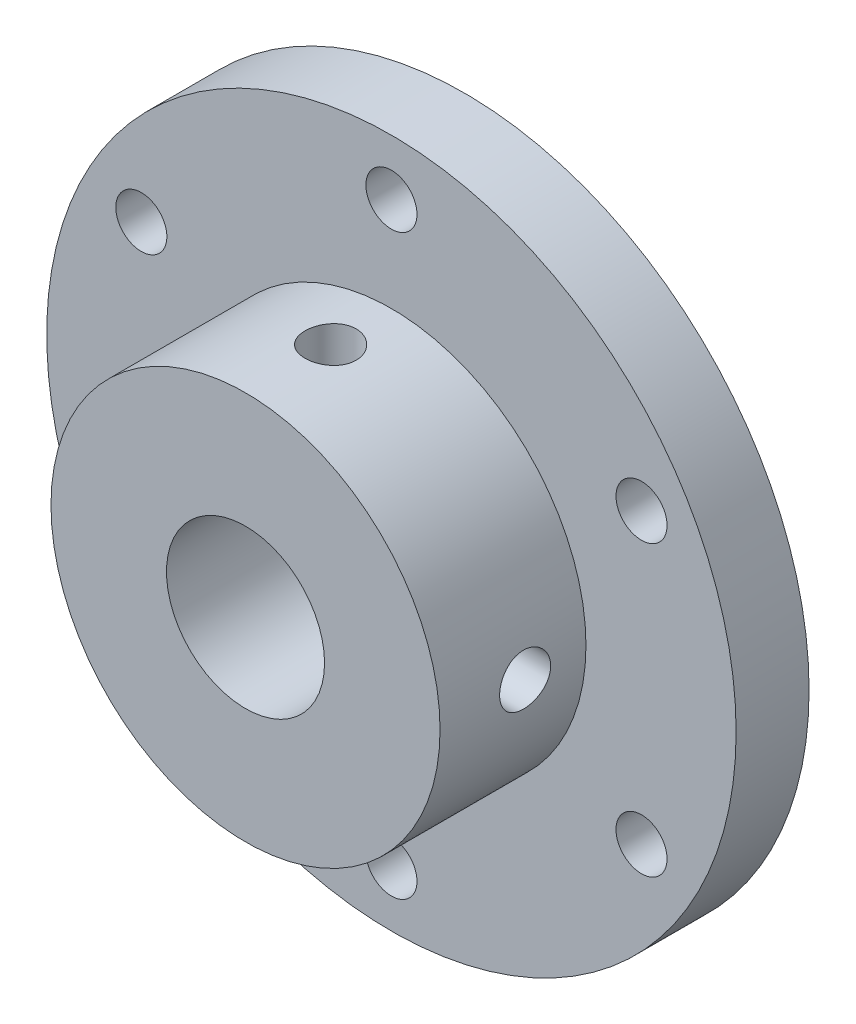
ISO-10303-21;
HEADER;
FILE_DESCRIPTION(('STEP AP214'),'2;1');
FILE_NAME('part.step','',(''),(''),'','','');
FILE_SCHEMA(('AUTOMOTIVE_DESIGN { 1 0 10303 214 1 1 1 1 }'));
ENDSEC;
DATA;
#1=APPLICATION_CONTEXT('core data for automotive mechanical design processes');
#2=APPLICATION_PROTOCOL_DEFINITION('international standard','automotive_design',2000,#1);
#3=PRODUCT_CONTEXT('',#1,'mechanical');
#4=PRODUCT('Part','Part','',(#3));
#5=PRODUCT_RELATED_PRODUCT_CATEGORY('part','',(#4));
#6=PRODUCT_DEFINITION_FORMATION('','',#4);
#7=PRODUCT_DEFINITION_CONTEXT('part definition',#1,'design');
#8=PRODUCT_DEFINITION('design','',#6,#7);
#9=PRODUCT_DEFINITION_SHAPE('','',#8);
#10=(LENGTH_UNIT() NAMED_UNIT(*) SI_UNIT(.MILLI.,.METRE.));
#11=(NAMED_UNIT(*) PLANE_ANGLE_UNIT() SI_UNIT($,.RADIAN.));
#12=(NAMED_UNIT(*) SI_UNIT($,.STERADIAN.) SOLID_ANGLE_UNIT());
#13=UNCERTAINTY_MEASURE_WITH_UNIT(LENGTH_MEASURE(1.E-05),#10,'distance_accuracy_value','');
#14=(GEOMETRIC_REPRESENTATION_CONTEXT(3) GLOBAL_UNCERTAINTY_ASSIGNED_CONTEXT((#13)) GLOBAL_UNIT_ASSIGNED_CONTEXT((#10,
#11,#12)) REPRESENTATION_CONTEXT('',''));
#15=CARTESIAN_POINT('',(0.,0.,0.));
#16=DIRECTION('',(0.,0.,1.));
#17=DIRECTION('',(1.,0.,0.));
#18=AXIS2_PLACEMENT_3D('',#15,#16,#17);
#19=CARTESIAN_POINT('',(0.,0.,6.));
#20=DIRECTION('',(0.,0.,-1.));
#21=DIRECTION('',(-1.,0.,0.));
#22=AXIS2_PLACEMENT_3D('',#19,#20,#21);
#23=CYLINDRICAL_SURFACE('',#22,28.35);
#24=CARTESIAN_POINT('',(0.,0.,6.));
#25=DIRECTION('',(0.,0.,1.));
#26=DIRECTION('',(1.,0.,0.));
#27=AXIS2_PLACEMENT_3D('',#24,#25,#26);
#28=CIRCLE('',#27,28.35);
#29=CARTESIAN_POINT('',(28.35,0.,6.));
#30=VERTEX_POINT('',#29);
#31=EDGE_CURVE('E10',#30,#30,#28,.T.);
#32=ORIENTED_EDGE('',*,*,#31,.F.);
#33=EDGE_LOOP('',(#32));
#34=FACE_BOUND('',#33,.T.);
#35=CARTESIAN_POINT('',(0.,0.,0.));
#36=DIRECTION('',(0.,0.,1.));
#37=DIRECTION('',(1.,0.,0.));
#38=AXIS2_PLACEMENT_3D('',#35,#36,#37);
#39=CIRCLE('',#38,28.35);
#40=CARTESIAN_POINT('',(28.35,0.,0.));
#41=VERTEX_POINT('',#40);
#42=EDGE_CURVE('E34',#41,#41,#39,.T.);
#43=ORIENTED_EDGE('',*,*,#42,.T.);
#44=EDGE_LOOP('',(#43));
#45=FACE_BOUND('',#44,.T.);
#46=ADVANCED_FACE('F31',(#34,#45),#23,.T.);
#47=CARTESIAN_POINT('',(0.,0.,6.));
#48=DIRECTION('',(0.,0.,1.));
#49=DIRECTION('',(1.,0.,0.));
#50=AXIS2_PLACEMENT_3D('',#47,#48,#49);
#51=PLANE('',#50);
#52=CARTESIAN_POINT('',(-20.5681033398804,-11.8750000000001,6.));
#53=DIRECTION('',(0.,0.,1.));
#54=DIRECTION('',(-0.500000000000004,0.866025403784436,0.));
#55=AXIS2_PLACEMENT_3D('',#52,#53,#54);
#56=CIRCLE('',#55,2.09999999999999);
#57=CARTESIAN_POINT('',(-21.6181033398804,-10.0563466520528,6.));
#58=VERTEX_POINT('',#57);
#59=EDGE_CURVE('E84',#58,#58,#56,.T.);
#60=ORIENTED_EDGE('',*,*,#59,.F.);
#61=EDGE_LOOP('',(#60));
#62=FACE_BOUND('',#61,.T.);
#63=CARTESIAN_POINT('',(0.,-23.75,6.));
#64=DIRECTION('',(0.,0.,1.));
#65=DIRECTION('',(-1.,0.,0.));
#66=AXIS2_PLACEMENT_3D('',#63,#64,#65);
#67=CIRCLE('',#66,2.09999999999999);
#68=CARTESIAN_POINT('',(-2.09999999999999,-23.75,6.));
#69=VERTEX_POINT('',#68);
#70=EDGE_CURVE('E78',#69,#69,#67,.T.);
#71=ORIENTED_EDGE('',*,*,#70,.F.);
#72=EDGE_LOOP('',(#71));
#73=FACE_BOUND('',#72,.T.);
#74=CARTESIAN_POINT('',(20.5681033398805,-11.8749999999998,6.));
#75=DIRECTION('',(0.,0.,1.));
#76=DIRECTION('',(-0.499999999999992,-0.866025403784443,0.));
#77=AXIS2_PLACEMENT_3D('',#74,#75,#76);
#78=CIRCLE('',#77,2.09999999999999);
#79=CARTESIAN_POINT('',(19.5181033398806,-13.6936533479471,6.));
#80=VERTEX_POINT('',#79);
#81=EDGE_CURVE('E70',#80,#80,#78,.T.);
#82=ORIENTED_EDGE('',*,*,#81,.F.);
#83=EDGE_LOOP('',(#82));
#84=FACE_BOUND('',#83,.T.);
#85=CARTESIAN_POINT('',(20.5681033398803,11.8750000000002,6.));
#86=DIRECTION('',(0.,0.,1.));
#87=DIRECTION('',(0.50000000000001,-0.866025403784433,0.));
#88=AXIS2_PLACEMENT_3D('',#85,#86,#87);
#89=CIRCLE('',#88,2.09999999999999);
#90=CARTESIAN_POINT('',(21.6181033398803,10.0563466520529,6.));
#91=VERTEX_POINT('',#90);
#92=EDGE_CURVE('E71',#91,#91,#89,.T.);
#93=ORIENTED_EDGE('',*,*,#92,.F.);
#94=EDGE_LOOP('',(#93));
#95=FACE_BOUND('',#94,.T.);
#96=CARTESIAN_POINT('',(-20.5681033398804,11.875,6.));
#97=DIRECTION('',(0.,0.,1.));
#98=DIRECTION('',(0.499999999999998,0.86602540378444,0.));
#99=AXIS2_PLACEMENT_3D('',#96,#97,#98);
#100=CIRCLE('',#99,2.09999999999999);
#101=CARTESIAN_POINT('',(-19.5181033398805,13.6936533479473,6.));
#102=VERTEX_POINT('',#101);
#103=EDGE_CURVE('E63',#102,#102,#100,.T.);
#104=ORIENTED_EDGE('',*,*,#103,.F.);
#105=EDGE_LOOP('',(#104));
#106=FACE_BOUND('',#105,.T.);
#107=CARTESIAN_POINT('',(0.,23.75,6.));
#108=DIRECTION('',(0.,0.,1.));
#109=DIRECTION('',(1.,0.,0.));
#110=AXIS2_PLACEMENT_3D('',#107,#108,#109);
#111=CIRCLE('',#110,2.09999999999999);
#112=CARTESIAN_POINT('',(2.09999999999999,23.75,6.));
#113=VERTEX_POINT('',#112);
#114=EDGE_CURVE('E52',#113,#113,#111,.T.);
#115=ORIENTED_EDGE('',*,*,#114,.F.);
#116=EDGE_LOOP('',(#115));
#117=FACE_BOUND('',#116,.T.);
#118=CARTESIAN_POINT('',(0.,0.,6.));
#119=DIRECTION('',(0.,0.,1.));
#120=DIRECTION('',(1.,0.,0.));
#121=AXIS2_PLACEMENT_3D('',#118,#119,#120);
#122=CIRCLE('',#121,16.);
#123=CARTESIAN_POINT('',(16.,0.,6.));
#124=VERTEX_POINT('',#123);
#125=EDGE_CURVE('E43',#124,#124,#122,.T.);
#126=ORIENTED_EDGE('',*,*,#125,.F.);
#127=EDGE_LOOP('',(#126));
#128=FACE_BOUND('',#127,.T.);
#129=ORIENTED_EDGE('',*,*,#31,.T.);
#130=EDGE_LOOP('',(#129));
#131=FACE_BOUND('',#130,.T.);
#132=ADVANCED_FACE('F145',(#62,#73,#84,#95,#106,#117,#128,#131),#51,.T.);
#133=CARTESIAN_POINT('',(0.,0.,0.));
#134=DIRECTION('',(0.,0.,1.));
#135=DIRECTION('',(1.,0.,0.));
#136=AXIS2_PLACEMENT_3D('',#133,#134,#135);
#137=PLANE('',#136);
#138=CARTESIAN_POINT('',(-20.5681033398804,-11.8750000000001,0.));
#139=DIRECTION('',(0.,0.,-1.));
#140=DIRECTION('',(0.500000000000004,-0.866025403784436,0.));
#141=AXIS2_PLACEMENT_3D('',#138,#139,#140);
#142=CIRCLE('',#141,2.09999999999999);
#143=CARTESIAN_POINT('',(-19.5181033398804,-13.6936533479474,0.));
#144=VERTEX_POINT('',#143);
#145=EDGE_CURVE('E66',#144,#144,#142,.T.);
#146=ORIENTED_EDGE('',*,*,#145,.F.);
#147=EDGE_LOOP('',(#146));
#148=FACE_BOUND('',#147,.T.);
#149=CARTESIAN_POINT('',(0.,-23.75,0.));
#150=DIRECTION('',(0.,0.,-1.));
#151=DIRECTION('',(1.,0.,0.));
#152=AXIS2_PLACEMENT_3D('',#149,#150,#151);
#153=CIRCLE('',#152,2.09999999999999);
#154=CARTESIAN_POINT('',(2.09999999999999,-23.75,0.));
#155=VERTEX_POINT('',#154);
#156=EDGE_CURVE('E81',#155,#155,#153,.T.);
#157=ORIENTED_EDGE('',*,*,#156,.F.);
#158=EDGE_LOOP('',(#157));
#159=FACE_BOUND('',#158,.T.);
#160=CARTESIAN_POINT('',(20.5681033398805,-11.8749999999998,0.));
#161=DIRECTION('',(0.,0.,-1.));
#162=DIRECTION('',(0.499999999999992,0.866025403784443,0.));
#163=AXIS2_PLACEMENT_3D('',#160,#161,#162);
#164=CIRCLE('',#163,2.09999999999999);
#165=CARTESIAN_POINT('',(21.6181033398805,-10.0563466520525,0.));
#166=VERTEX_POINT('',#165);
#167=EDGE_CURVE('E75',#166,#166,#164,.T.);
#168=ORIENTED_EDGE('',*,*,#167,.F.);
#169=EDGE_LOOP('',(#168));
#170=FACE_BOUND('',#169,.T.);
#171=CARTESIAN_POINT('',(20.5681033398803,11.8750000000002,0.));
#172=DIRECTION('',(0.,0.,-1.));
#173=DIRECTION('',(-0.50000000000001,0.866025403784433,0.));
#174=AXIS2_PLACEMENT_3D('',#171,#172,#173);
#175=CIRCLE('',#174,2.09999999999999);
#176=CARTESIAN_POINT('',(19.5181033398803,13.6936533479475,0.));
#177=VERTEX_POINT('',#176);
#178=EDGE_CURVE('E67',#177,#177,#175,.T.);
#179=ORIENTED_EDGE('',*,*,#178,.F.);
#180=EDGE_LOOP('',(#179));
#181=FACE_BOUND('',#180,.T.);
#182=CARTESIAN_POINT('',(-20.5681033398804,11.875,0.));
#183=DIRECTION('',(0.,0.,-1.));
#184=DIRECTION('',(-0.499999999999998,-0.86602540378444,0.));
#185=AXIS2_PLACEMENT_3D('',#182,#183,#184);
#186=CIRCLE('',#185,2.09999999999999);
#187=CARTESIAN_POINT('',(-21.6181033398804,10.0563466520526,0.));
#188=VERTEX_POINT('',#187);
#189=EDGE_CURVE('E60',#188,#188,#186,.T.);
#190=ORIENTED_EDGE('',*,*,#189,.F.);
#191=EDGE_LOOP('',(#190));
#192=FACE_BOUND('',#191,.T.);
#193=CARTESIAN_POINT('',(0.,23.75,0.));
#194=DIRECTION('',(0.,0.,-1.));
#195=DIRECTION('',(-1.,0.,0.));
#196=AXIS2_PLACEMENT_3D('',#193,#194,#195);
#197=CIRCLE('',#196,2.09999999999999);
#198=CARTESIAN_POINT('',(-2.09999999999999,23.75,0.));
#199=VERTEX_POINT('',#198);
#200=EDGE_CURVE('E57',#199,#199,#197,.T.);
#201=ORIENTED_EDGE('',*,*,#200,.F.);
#202=EDGE_LOOP('',(#201));
#203=FACE_BOUND('',#202,.T.);
#204=CARTESIAN_POINT('',(0.,0.,0.));
#205=DIRECTION('',(0.,0.,1.));
#206=DIRECTION('',(1.,0.,0.));
#207=AXIS2_PLACEMENT_3D('',#204,#205,#206);
#208=CIRCLE('',#207,6.5);
#209=CARTESIAN_POINT('',(6.5,0.,0.));
#210=VERTEX_POINT('',#209);
#211=EDGE_CURVE('E46',#210,#210,#208,.T.);
#212=ORIENTED_EDGE('',*,*,#211,.T.);
#213=EDGE_LOOP('',(#212));
#214=FACE_BOUND('',#213,.T.);
#215=ORIENTED_EDGE('',*,*,#42,.F.);
#216=EDGE_LOOP('',(#215));
#217=FACE_BOUND('',#216,.T.);
#218=ADVANCED_FACE('F143',(#148,#159,#170,#181,#192,#203,#214,#217),#137,.F.);
#219=CARTESIAN_POINT('',(0.,0.,18.));
#220=DIRECTION('',(0.,0.,-1.));
#221=DIRECTION('',(-1.,0.,0.));
#222=AXIS2_PLACEMENT_3D('',#219,#220,#221);
#223=CYLINDRICAL_SURFACE('',#222,16.);
#224=CARTESIAN_POINT('',(-2.10000000000006,15.8615888233178,11.));
#225=CARTESIAN_POINT('',(-2.09999503865401,15.8615905824944,11.1174115736314));
#226=CARTESIAN_POINT('',(-2.09011998696355,15.8629065723081,11.234895314712));
#227=CARTESIAN_POINT('',(-2.05088458166068,15.8680259877536,11.4665896856767));
#228=CARTESIAN_POINT('',(-2.02150418290696,15.8718319722301,11.5807968221899));
#229=CARTESIAN_POINT('',(-1.94414221458781,15.8814930294597,11.8025500841338));
#230=CARTESIAN_POINT('',(-1.89617365397948,15.8873466688799,11.9101008071534));
#231=CARTESIAN_POINT('',(-1.78302555588174,15.9004417597124,12.1156072600464));
#232=CARTESIAN_POINT('',(-1.71784882632248,15.9076829846537,12.213564551749));
#233=CARTESIAN_POINT('',(-1.57170500868559,15.9227872531207,12.3977255456242));
#234=CARTESIAN_POINT('',(-1.49065302607998,15.9306534982904,12.4838616235429));
#235=CARTESIAN_POINT('',(-1.31524239583252,15.9460927423456,12.6413505102766));
#236=CARTESIAN_POINT('',(-1.22088307082077,15.9536657262786,12.7127025660989));
#237=CARTESIAN_POINT('',(-1.02110910583803,15.9676981402617,12.8388423451737));
#238=CARTESIAN_POINT('',(-0.915655330127145,15.9741534003327,12.893568590543));
#239=CARTESIAN_POINT('',(-0.69695486226004,15.9851877751582,12.984509331254));
#240=CARTESIAN_POINT('',(-0.583708487975233,15.9897669663876,13.0207245811788));
#241=CARTESIAN_POINT('',(-0.353330460697401,15.9965106933716,13.0734125044933));
#242=CARTESIAN_POINT('',(-0.236224983156342,15.9986890033625,13.0899978387998));
#243=CARTESIAN_POINT('',(-0.000874100572473952,16.0004326099706,13.103304442767));
#244=CARTESIAN_POINT('',(0.117371255075849,15.9999980193093,13.100026569334));
#245=CARTESIAN_POINT('',(0.35087833762374,15.9965759029859,13.0737897694546));
#246=CARTESIAN_POINT('',(0.4661539423191,15.9936040956731,13.0509520159592));
#247=CARTESIAN_POINT('',(0.691222189245984,15.9854590627758,12.9864333372268));
#248=CARTESIAN_POINT('',(0.801014718265018,15.9802857917572,12.9447520230935));
#249=CARTESIAN_POINT('',(1.01237338156598,15.9682920133749,12.8436016723495));
#250=CARTESIAN_POINT('',(1.11391429593375,15.9614666923073,12.7840805314492));
#251=CARTESIAN_POINT('',(1.30561226868734,15.9469317508888,12.648978047026));
#252=CARTESIAN_POINT('',(1.39576875138066,15.9392220858556,12.5733958918414));
#253=CARTESIAN_POINT('',(1.56285110932746,15.9237120092462,12.40763904381));
#254=CARTESIAN_POINT('',(1.63967218668247,15.915911351597,12.317358699886));
#255=CARTESIAN_POINT('',(1.77708767842581,15.9011556413831,12.125130199615));
#256=CARTESIAN_POINT('',(1.83768203208293,15.8942005919833,12.0231819996012));
#257=CARTESIAN_POINT('',(1.94093190747743,15.8819237266012,11.8104146567639));
#258=CARTESIAN_POINT('',(1.98357848172793,15.8766027255957,11.6995911220202));
#259=CARTESIAN_POINT('',(2.04962638679575,15.8682119456668,11.4722699997426));
#260=CARTESIAN_POINT('',(2.07302874382802,15.8651420467023,11.3557727151173));
#261=CARTESIAN_POINT('',(2.09978397161809,15.8616232155511,11.1213381832076));
#262=CARTESIAN_POINT('',(2.10328457535237,15.8611549715753,11.0034180752773));
#263=CARTESIAN_POINT('',(2.09052724007331,15.8628413480338,10.7686730463954));
#264=CARTESIAN_POINT('',(2.07426976656693,15.8649959066739,10.6518480997067));
#265=CARTESIAN_POINT('',(2.0225823706617,15.8716674755992,10.4230558240977));
#266=CARTESIAN_POINT('',(1.98722446430015,15.8761756098626,10.3110719445128));
#267=CARTESIAN_POINT('',(1.89841419661061,15.8870391552302,10.0946218750628));
#268=CARTESIAN_POINT('',(1.84496113825426,15.8933946374932,9.99015597497953));
#269=CARTESIAN_POINT('',(1.72111661237134,15.9072828621677,9.79104030714641));
#270=CARTESIAN_POINT('',(1.65062855562031,15.9148222286687,9.69645108493687));
#271=CARTESIAN_POINT('',(1.49485093781858,15.9302081334384,9.5203926570621));
#272=CARTESIAN_POINT('',(1.40956074068912,15.9380546848961,9.43892401550569));
#273=CARTESIAN_POINT('',(1.22595332308549,15.953230421671,9.29089767818666));
#274=CARTESIAN_POINT('',(1.1275573435102,15.960556032335,9.22443725358232));
#275=CARTESIAN_POINT('',(0.920912814352222,15.9738105656972,9.10898804891187));
#276=CARTESIAN_POINT('',(0.812664480633403,15.9797395189859,9.05999888616815));
#277=CARTESIAN_POINT('',(0.589706660026009,15.9895168901588,8.98104224709306));
#278=CARTESIAN_POINT('',(0.475017106070629,15.9933713739985,8.95101926652003));
#279=CARTESIAN_POINT('',(0.242170724127597,15.9985907667921,8.91066687196954));
#280=CARTESIAN_POINT('',(0.124014069649451,15.9999558001144,8.90033647418645));
#281=CARTESIAN_POINT('',(-0.111464216223486,16.0000417507799,8.89968218354243));
#282=CARTESIAN_POINT('',(-0.228785452419385,15.9987824545172,8.90920857852814));
#283=CARTESIAN_POINT('',(-0.460143744297162,15.9938006947454,8.94767947971673));
#284=CARTESIAN_POINT('',(-0.574180803962358,15.990078234224,8.97662396236672));
#285=CARTESIAN_POINT('',(-0.795708952475244,15.9805864765404,9.05306092962894));
#286=CARTESIAN_POINT('',(-0.903202817232381,15.9748180545559,9.10054548443884));
#287=CARTESIAN_POINT('',(-1.10872031686901,15.9618719008641,9.21269912599318));
#288=CARTESIAN_POINT('',(-1.20674379268263,15.9546941454915,9.27736850130769));
#289=CARTESIAN_POINT('',(-1.39130171449957,15.9396652334754,9.4226072173219));
#290=CARTESIAN_POINT('',(-1.47774825944987,15.9318095960857,9.50328779959426));
#291=CARTESIAN_POINT('',(-1.63593288418693,15.9163456055099,9.6780263832615));
#292=CARTESIAN_POINT('',(-1.70766748484266,15.9087373111734,9.77208754005411));
#293=CARTESIAN_POINT('',(-1.83465680030677,15.8945948860146,9.97137995438901));
#294=CARTESIAN_POINT('',(-1.88984006122843,15.88806546572,10.0766570578836));
#295=CARTESIAN_POINT('',(-1.98166389697518,15.8768752263866,10.2950133840183));
#296=CARTESIAN_POINT('',(-2.01832442480928,15.8722123977528,10.4080840613776));
#297=CARTESIAN_POINT('',(-2.06339087777286,15.8664027800374,10.6014356792983));
#298=CARTESIAN_POINT('',(-2.07709926760444,15.8646066699888,10.6805024680319));
#299=CARTESIAN_POINT('',(-2.09540548278716,15.8621990962252,10.8397016295647));
#300=CARTESIAN_POINT('',(-2.10000338749661,15.8615876221912,10.9198339930761));
#301=CARTESIAN_POINT('',(-2.10000000000006,15.8615888233178,11.));
#302=B_SPLINE_CURVE_WITH_KNOTS('',3,(#224,#225,#226,#227,#228,#229,#230,#231,#232,#233,#234,
#235,#236,#237,#238,#239,#240,#241,#242,#243,#244,#245,#246,#247,#248,#249,#250,#251,#252,#253,
#254,#255,#256,#257,#258,#259,#260,#261,#262,#263,#264,#265,#266,#267,#268,#269,#270,#271,#272,
#273,#274,#275,#276,#277,#278,#279,#280,#281,#282,#283,#284,#285,#286,#287,#288,#289,#290,#291,
#292,#293,#294,#295,#296,#297,#298,#299,#300,#301),.UNSPECIFIED.,.T.,.F.,(4,2,2,2,2,2,2,2,2,2,2,
2,2,2,2,2,2,2,2,2,2,2,2,2,2,2,2,2,2,2,2,2,2,2,2,2,2,2,4),(0.,0.351941826466599,
0.704245895485887,1.05630384790078,1.40830438898727,1.76224138030218,2.11619639421338,
2.4714447419189,2.82667860710887,3.17986365596907,3.53303346840337,3.88403109850272,
4.23503597287576,4.58707617636271,4.93913417483675,5.29384460519827,5.64855636310397,
6.00344474620009,6.35831420333087,6.71054594977099,7.06276939767325,7.41367400234566,
7.76459212546188,8.11754868359529,8.47052041276332,8.82571804990381,9.18090790658014,
9.53505343063468,9.88918126175909,10.2406487734036,10.5921158587415,10.9434327819457,
11.2947556048887,11.6486106345029,12.0025492487217,12.3579945596307,12.7130561579591,
12.9533562901213,13.1936543291026),.UNSPECIFIED.);
#303=CARTESIAN_POINT('',(-2.10000000000006,15.8615888233178,11.));
#304=VERTEX_POINT('',#303);
#305=EDGE_CURVE('E241',#304,#304,#302,.T.);
#306=ORIENTED_EDGE('',*,*,#305,.F.);
#307=EDGE_LOOP('',(#306));
#308=FACE_BOUND('',#307,.T.);
#309=CARTESIAN_POINT('',(16.,0.,8.9));
#310=CARTESIAN_POINT('',(15.9999982962631,0.117416484353102,8.90000495705236));
#311=CARTESIAN_POINT('',(15.9986938773925,0.234905122011887,8.90988080691643));
#312=CARTESIAN_POINT('',(15.9936157778764,0.466609665583491,8.94911967052718));
#313=CARTESIAN_POINT('',(15.9898395595276,0.580822081998048,8.97850271201433));
#314=CARTESIAN_POINT('',(15.9802430281394,0.802586512568987,9.0558724099226));
#315=CARTESIAN_POINT('',(15.9744241309754,0.910143079615394,9.10384618263218));
#316=CARTESIAN_POINT('',(15.9613884397463,1.1156593399402,9.21700655797674));
#317=CARTESIAN_POINT('',(15.9541718747973,1.21362060219517,9.28219034005324));
#318=CARTESIAN_POINT('',(15.9390970395828,1.39777717587375,9.4283413083698));
#319=CARTESIAN_POINT('',(15.9312355150333,1.48390610575507,9.50939181113075));
#320=CARTESIAN_POINT('',(15.9157828604001,1.64138117851605,9.68479647193949));
#321=CARTESIAN_POINT('',(15.908191744508,1.71272654645484,9.77915132695387));
#322=CARTESIAN_POINT('',(15.8941075163014,1.83885928171324,9.9789213126258));
#323=CARTESIAN_POINT('',(15.8876186009931,1.89358395666576,10.0843763480338));
#324=CARTESIAN_POINT('',(15.8765168113299,1.98452144739535,10.3030795517579));
#325=CARTESIAN_POINT('',(15.8719038586674,2.02073503589053,10.4163273945506));
#326=CARTESIAN_POINT('',(15.8651076274545,2.0734195616491,10.6467101739999));
#327=CARTESIAN_POINT('',(15.8629105101852,2.0900029894288,10.7638189706013));
#328=CARTESIAN_POINT('',(15.8611524584727,2.10330463008907,10.9991763708029));
#329=CARTESIAN_POINT('',(15.8615914075016,2.10002372107694,11.1174249237892));
#330=CARTESIAN_POINT('',(15.8650432287045,2.07378206445453,11.3509187553438));
#331=CARTESIAN_POINT('',(15.86803985239,2.05094554741099,11.4661782702577));
#332=CARTESIAN_POINT('',(15.8762440291591,1.98643489899058,11.6912149779756));
#333=CARTESIAN_POINT('',(15.8814516312202,1.94476035031288,11.8009920492725));
#334=CARTESIAN_POINT('',(15.8935093147413,1.84362411100889,12.0123317781193));
#335=CARTESIAN_POINT('',(15.9003643391794,1.78410875473803,12.1138684605443));
#336=CARTESIAN_POINT('',(15.9149407211294,1.64901867206017,12.3055604124573));
#337=CARTESIAN_POINT('',(15.9226621222936,1.57344313629226,12.395715107979));
#338=CARTESIAN_POINT('',(15.9381733835384,1.40769104741128,12.5628047526722));
#339=CARTESIAN_POINT('',(15.9459633163989,1.31740747591083,12.6396335731953));
#340=CARTESIAN_POINT('',(15.9606788849759,1.12516973659487,12.7770631591691));
#341=CARTESIAN_POINT('',(15.9676045183355,1.02321553695397,12.8376638803649));
#342=CARTESIAN_POINT('',(15.9798160936183,0.81044643682083,12.9409183626589));
#343=CARTESIAN_POINT('',(15.9851013953531,0.699628098002016,12.9835651189946));
#344=CARTESIAN_POINT('',(15.9934311173904,0.472318289200564,13.0496149743927));
#345=CARTESIAN_POINT('',(15.9964756534268,0.355827112547463,13.0730190673325));
#346=CARTESIAN_POINT('',(15.9999656992249,0.12139562938738,13.0997808566157));
#347=CARTESIAN_POINT('',(16.0004301540478,0.00347227541262437,13.103284681241));
#348=CARTESIAN_POINT('',(15.9987589549612,-0.231280014343777,13.0905326292899));
#349=CARTESIAN_POINT('',(15.9966233622396,-0.348108975814989,13.0742772177153));
#350=CARTESIAN_POINT('',(15.990003800972,-0.57692228410594,13.0225895536893));
#351=CARTESIAN_POINT('',(15.9855284102365,-0.688922719796447,12.9872273319612));
#352=CARTESIAN_POINT('',(15.974730073111,-0.905403997412976,12.8984029024912));
#353=CARTESIAN_POINT('',(15.9684070581947,-1.00988456025589,12.8449400234038));
#354=CARTESIAN_POINT('',(15.9545706371482,-1.2090105555854,12.721080854769));
#355=CARTESIAN_POINT('',(15.947050698098,-1.30359699513709,12.6505904659569));
#356=CARTESIAN_POINT('',(15.9316811346644,-1.47964872574463,12.4948098674338));
#357=CARTESIAN_POINT('',(15.9238314958089,-1.56111344006267,12.4095190075414));
#358=CARTESIAN_POINT('',(15.9086283992346,-1.70913080865221,12.2259132317372));
#359=CARTESIAN_POINT('',(15.9012783770394,-1.77558633636806,12.1275196890213));
#360=CARTESIAN_POINT('',(15.8879642527691,-1.89102695628024,11.9208813855286));
#361=CARTESIAN_POINT('',(15.8820001205454,-1.94001242853153,11.8126368391213));
#362=CARTESIAN_POINT('',(15.8721568354206,-2.01896672841903,11.5896770175875));
#363=CARTESIAN_POINT('',(15.8682717771357,-2.04898946191644,11.4749811034711));
#364=CARTESIAN_POINT('',(15.8630098837321,-2.08933920892608,11.242121268751));
#365=CARTESIAN_POINT('',(15.8616329189455,-2.09966724065019,11.1239575277539));
#366=CARTESIAN_POINT('',(15.8615471546198,-2.10031443069061,10.8884829294453));
#367=CARTESIAN_POINT('',(15.8628180045269,-2.09078619999575,10.7711724699154));
#368=CARTESIAN_POINT('',(15.8678408142836,-2.05231540968838,10.5398362007954));
#369=CARTESIAN_POINT('',(15.8715927735212,-2.02337285486407,10.4258103903953));
#370=CARTESIAN_POINT('',(15.8811485642185,-1.94694420408523,10.2043055075203));
#371=CARTESIAN_POINT('',(15.8869514953252,-1.89946624400469,10.096823586585));
#372=CARTESIAN_POINT('',(15.8999567709492,-1.78732950445978,9.89132723687448));
#373=CARTESIAN_POINT('',(15.9071591400699,-1.7226704229297,9.79331297459389));
#374=CARTESIAN_POINT('',(15.9222180092564,-1.57744326503153,9.60875508025564));
#375=CARTESIAN_POINT('',(15.9300789344295,-1.49676157774286,9.52230120152492));
#376=CARTESIAN_POINT('',(15.9455305998353,-1.32201773458277,9.36410229468749));
#377=CARTESIAN_POINT('',(15.9531212761728,-1.22795244033518,9.29236072619036));
#378=CARTESIAN_POINT('',(15.9672126278133,-1.02865642383035,9.16536363306548));
#379=CARTESIAN_POINT('',(15.9737086069784,-0.923380607893781,9.11017838182219));
#380=CARTESIAN_POINT('',(15.9848315489309,-0.705026961411323,9.01835047192647));
#381=CARTESIAN_POINT('',(15.9894605194548,-0.591957665878867,8.98168788366503));
#382=CARTESIAN_POINT('',(15.9952257223333,-0.398600577498265,8.93661582244385));
#383=CARTESIAN_POINT('',(15.9970072452264,-0.319526543474694,8.92290490974843));
#384=CARTESIAN_POINT('',(15.9993949607654,-0.160312880332424,8.90459534461191));
#385=CARTESIAN_POINT('',(16.0000011633302,-0.0801732602122652,8.89999661527041));
#386=CARTESIAN_POINT('',(16.,0.,8.9));
#387=B_SPLINE_CURVE_WITH_KNOTS('',3,(#309,#310,#311,#312,#313,#314,#315,#316,#317,#318,#319,
#320,#321,#322,#323,#324,#325,#326,#327,#328,#329,#330,#331,#332,#333,#334,#335,#336,#337,#338,
#339,#340,#341,#342,#343,#344,#345,#346,#347,#348,#349,#350,#351,#352,#353,#354,#355,#356,#357,
#358,#359,#360,#361,#362,#363,#364,#365,#366,#367,#368,#369,#370,#371,#372,#373,#374,#375,#376,
#377,#378,#379,#380,#381,#382,#383,#384,#385,#386),.UNSPECIFIED.,.T.,.F.,(4,2,2,2,2,2,2,2,2,2,2,
2,2,2,2,2,2,2,2,2,2,2,2,2,2,2,2,2,2,2,2,2,2,2,2,2,2,2,4),(0.,0.351956579597512,
0.704275067694988,1.05634982812868,1.40836692260358,1.76228460352201,2.11622083179281,
2.47147596652804,2.82671627044793,3.17991086217002,3.53308984096312,3.88404169036012,
4.2350013144372,4.58702741286475,4.9390712560353,5.29380151830567,5.64853274793558,
6.00340224843457,6.35825341888271,6.71049550361346,7.06272929905446,7.41368075090289,
7.76464522081314,8.11759548065947,8.47056124946069,8.82574953425382,9.18093009157842,
9.53509636913481,9.88924433587379,10.2406804386663,10.5921164547833,10.9433983857755,
11.2946864931543,11.6485606276522,12.0025178807118,12.3579569170413,12.7130126970205,
12.9533345286082,13.1936543320409),.UNSPECIFIED.);
#388=CARTESIAN_POINT('',(16.,0.,8.9));
#389=VERTEX_POINT('',#388);
#390=EDGE_CURVE('E74',#389,#389,#387,.T.);
#391=ORIENTED_EDGE('',*,*,#390,.F.);
#392=EDGE_LOOP('',(#391));
#393=FACE_BOUND('',#392,.T.);
#394=CARTESIAN_POINT('',(0.,0.,18.));
#395=DIRECTION('',(0.,0.,1.));
#396=DIRECTION('',(1.,0.,0.));
#397=AXIS2_PLACEMENT_3D('',#394,#395,#396);
#398=CIRCLE('',#397,16.);
#399=CARTESIAN_POINT('',(16.,0.,18.));
#400=VERTEX_POINT('',#399);
#401=EDGE_CURVE('E41',#400,#400,#398,.T.);
#402=ORIENTED_EDGE('',*,*,#401,.F.);
#403=EDGE_LOOP('',(#402));
#404=FACE_BOUND('',#403,.T.);
#405=ORIENTED_EDGE('',*,*,#125,.T.);
#406=EDGE_LOOP('',(#405));
#407=FACE_BOUND('',#406,.T.);
#408=ADVANCED_FACE('F139',(#308,#393,#404,#407),#223,.T.);
#409=CARTESIAN_POINT('',(0.,0.,18.));
#410=DIRECTION('',(0.,0.,1.));
#411=DIRECTION('',(1.,0.,0.));
#412=AXIS2_PLACEMENT_3D('',#409,#410,#411);
#413=PLANE('',#412);
#414=CARTESIAN_POINT('',(0.,0.,18.));
#415=DIRECTION('',(0.,0.,1.));
#416=DIRECTION('',(1.,0.,0.));
#417=AXIS2_PLACEMENT_3D('',#414,#415,#416);
#418=CIRCLE('',#417,6.5);
#419=CARTESIAN_POINT('',(6.5,0.,18.));
#420=VERTEX_POINT('',#419);
#421=EDGE_CURVE('E49',#420,#420,#418,.T.);
#422=ORIENTED_EDGE('',*,*,#421,.F.);
#423=EDGE_LOOP('',(#422));
#424=FACE_BOUND('',#423,.T.);
#425=ORIENTED_EDGE('',*,*,#401,.T.);
#426=EDGE_LOOP('',(#425));
#427=FACE_BOUND('',#426,.T.);
#428=ADVANCED_FACE('F135',(#424,#427),#413,.T.);
#429=CARTESIAN_POINT('',(0.,0.,0.));
#430=DIRECTION('',(0.,0.,1.));
#431=DIRECTION('',(1.,0.,0.));
#432=AXIS2_PLACEMENT_3D('',#429,#430,#431);
#433=CYLINDRICAL_SURFACE('',#432,6.5);
#434=CARTESIAN_POINT('',(-2.10000000000002,6.15142259969187,11.));
#435=CARTESIAN_POINT('',(-2.09999985504443,6.15142280452303,10.8853964744493));
#436=CARTESIAN_POINT('',(-2.09058680517284,6.15466029046309,10.7707906126903));
#437=CARTESIAN_POINT('',(-2.05330060667947,6.16719821845155,10.5449600757031));
#438=CARTESIAN_POINT('',(-2.02542346371752,6.17649997237716,10.4337361375334));
#439=CARTESIAN_POINT('',(-1.95227909620044,6.20000528560768,10.2179751799125));
#440=CARTESIAN_POINT('',(-1.90704428712473,6.21419970285656,10.1134261170915));
#441=CARTESIAN_POINT('',(-1.80057810748953,6.24587799260998,9.913369336548));
#442=CARTESIAN_POINT('',(-1.73934355056383,6.26336252014907,9.81786342494571));
#443=CARTESIAN_POINT('',(-1.60020683517588,6.30037131839839,9.63509567792994));
#444=CARTESIAN_POINT('',(-1.52181717786719,6.31994414985837,9.54821470529948));
#445=CARTESIAN_POINT('',(-1.35163723324834,6.35851237073016,9.38857460198202));
#446=CARTESIAN_POINT('',(-1.2598449412362,6.37750767324351,9.3158175876883));
#447=CARTESIAN_POINT('',(-1.06270432973735,6.41333944092537,9.18478636627789));
#448=CARTESIAN_POINT('',(-0.957080422160607,6.43011210127293,9.12690780508467));
#449=CARTESIAN_POINT('',(-0.736962150181889,6.45903914221564,9.02988783292386));
#450=CARTESIAN_POINT('',(-0.622470031367131,6.47119468737288,8.99074169648096));
#451=CARTESIAN_POINT('',(-0.39185592028106,6.48917405567726,8.93357939006609));
#452=CARTESIAN_POINT('',(-0.275910935999329,6.49519270755199,8.91491151528733));
#453=CARTESIAN_POINT('',(-0.0423886120736935,6.50090999302641,8.8971671147177));
#454=CARTESIAN_POINT('',(0.0751883247966083,6.50061015928488,8.89808583785684));
#455=CARTESIAN_POINT('',(0.304037179136666,6.49385810091939,8.91906750982062));
#456=CARTESIAN_POINT('',(0.415381721359455,6.48763314234893,8.93842330050034));
#457=CARTESIAN_POINT('',(0.633147816494777,6.47001270134365,8.99456479778312));
#458=CARTESIAN_POINT('',(0.739569040981949,6.45861687451632,9.03135166534589));
#459=CARTESIAN_POINT('',(0.946056341644139,6.43163793537417,9.12174449098016));
#460=CARTESIAN_POINT('',(1.04602442879809,6.41600343353855,9.17555831795104));
#461=CARTESIAN_POINT('',(1.23572596607453,6.38218452976531,9.29830851107183));
#462=CARTESIAN_POINT('',(1.32545668584352,6.36399945044638,9.3672488972811));
#463=CARTESIAN_POINT('',(1.49634844007109,6.32605299004046,9.52189259321369));
#464=CARTESIAN_POINT('',(1.57695224870374,6.30625747012239,9.60820416761806));
#465=CARTESIAN_POINT('',(1.72271467070764,6.26800983359126,9.79329660756869));
#466=CARTESIAN_POINT('',(1.78787119426716,6.24955789898107,9.89207915750448));
#467=CARTESIAN_POINT('',(1.90159856056157,6.21590694868392,10.1009791362579));
#468=CARTESIAN_POINT('',(1.94994873730845,6.20075212299426,10.2112243524527));
#469=CARTESIAN_POINT('',(2.02721623806654,6.17592589427176,10.438902035562));
#470=CARTESIAN_POINT('',(2.05614111977421,6.16625235889157,10.5563316878411));
#471=CARTESIAN_POINT('',(2.09263228842349,6.15396191257835,10.7896763107283));
#472=CARTESIAN_POINT('',(2.10105724122175,6.15106152189442,10.9054421237108));
#473=CARTESIAN_POINT('',(2.09873086685478,6.15185601202992,11.1367461316477));
#474=CARTESIAN_POINT('',(2.08798275741795,6.15554978618054,11.2522843615386));
#475=CARTESIAN_POINT('',(2.04838489455552,6.16883514939986,11.4760530715371));
#476=CARTESIAN_POINT('',(2.02011766731702,6.17823675035975,11.5843991046007));
#477=CARTESIAN_POINT('',(1.94697541954312,6.20167328374166,11.7947935730401));
#478=CARTESIAN_POINT('',(1.90209756995906,6.21570900538289,11.896840932197));
#479=CARTESIAN_POINT('',(1.79546296878225,6.24735835732388,12.095157411373));
#480=CARTESIAN_POINT('',(1.73323700957727,6.26506731546763,12.1911586241181));
#481=CARTESIAN_POINT('',(1.59421223569956,6.3018766851924,12.3716682377343));
#482=CARTESIAN_POINT('',(1.51740937816818,6.32097748188806,12.4561734390324));
#483=CARTESIAN_POINT('',(1.34732599133895,6.35945250020933,12.6151970685348));
#484=CARTESIAN_POINT('',(1.25346188437601,6.37880070640702,12.6890993536995));
#485=CARTESIAN_POINT('',(1.05419225981702,6.41474189731417,12.8201359406567));
#486=CARTESIAN_POINT('',(0.948787218332765,6.43133499561234,12.8772709338127));
#487=CARTESIAN_POINT('',(0.730020848560365,6.45980941724674,12.9726127347391));
#488=CARTESIAN_POINT('',(0.616721111125549,6.47172325718954,13.0109506455381));
#489=CARTESIAN_POINT('',(0.384825409387281,6.48963873082543,13.0678855334126));
#490=CARTESIAN_POINT('',(0.266231242830704,6.49564235563512,13.0864891590164));
#491=CARTESIAN_POINT('',(0.0327663983445258,6.5009197882972,13.1028578180877));
#492=CARTESIAN_POINT('',(-0.0820363084294203,6.50048011103237,13.1015100058771));
#493=CARTESIAN_POINT('',(-0.309704252130871,6.4936162151372,13.0801809599306));
#494=CARTESIAN_POINT('',(-0.422569629878692,6.48719243337076,13.0602010864105));
#495=CARTESIAN_POINT('',(-0.641578671840432,6.46918014696536,13.0027523743789));
#496=CARTESIAN_POINT('',(-0.747794857081479,6.45766601990327,12.9655350408104));
#497=CARTESIAN_POINT('',(-0.952521744001546,6.43065906375609,12.8748976767676));
#498=CARTESIAN_POINT('',(-1.05103108026139,6.41516553171469,12.8214747833015));
#499=CARTESIAN_POINT('',(-1.24135560021727,6.38112202357321,12.6977551048053));
#500=CARTESIAN_POINT('',(-1.33280915822902,6.36248309275134,12.6269267787308));
#501=CARTESIAN_POINT('',(-1.50282496369865,6.3244857783267,12.4713274281382));
#502=CARTESIAN_POINT('',(-1.5813832107157,6.30512717373923,12.3865520931861));
#503=CARTESIAN_POINT('',(-1.7262519018145,6.26704677431351,12.2018000880324));
#504=CARTESIAN_POINT('',(-1.79201760360819,6.24837322146682,12.1013850188834));
#505=CARTESIAN_POINT('',(-1.90568035031737,6.21465329085204,11.8903553880707));
#506=CARTESIAN_POINT('',(-1.95358337270854,6.19960570030791,11.7797442538473));
#507=CARTESIAN_POINT('',(-2.02739685259355,6.17584589972121,11.5588587689594));
#508=CARTESIAN_POINT('',(-2.05453849590778,6.16678433853381,11.4490334854276));
#509=CARTESIAN_POINT('',(-2.09083750968701,6.15457345253725,11.2261389198753));
#510=CARTESIAN_POINT('',(-2.1000001430167,6.15142239760052,11.1130705970018));
#511=CARTESIAN_POINT('',(-2.10000000000002,6.15142259969187,11.));
#512=B_SPLINE_CURVE_WITH_KNOTS('',3,(#434,#435,#436,#437,#438,#439,#440,#441,#442,#443,#444,
#445,#446,#447,#448,#449,#450,#451,#452,#453,#454,#455,#456,#457,#458,#459,#460,#461,#462,#463,
#464,#465,#466,#467,#468,#469,#470,#471,#472,#473,#474,#475,#476,#477,#478,#479,#480,#481,#482,
#483,#484,#485,#486,#487,#488,#489,#490,#491,#492,#493,#494,#495,#496,#497,#498,#499,#500,#501,
#502,#503,#504,#505,#506,#507,#508,#509,#510,#511),.UNSPECIFIED.,.T.,.F.,(4,2,2,2,2,2,2,2,2,2,2,
2,2,2,2,2,2,2,2,2,2,2,2,2,2,2,2,2,2,2,2,2,2,2,2,2,2,2,4),(0.,0.343392381123378,0.68685907264825,
1.02968743673573,1.37258412755157,1.72690936010448,2.08128764532633,2.44429209867041,
2.80720493151845,3.15819942399034,3.50910877761223,3.84707897760315,4.18507169054337,
4.52736116246133,4.86974171221523,5.22732065083602,5.58494793755023,5.94710765442172,
6.30912638597773,6.65569856426466,7.00221258438082,7.33778079094713,7.6734061763437,
8.01917681008666,8.36504348277603,8.72638784666054,9.08771730919187,9.44648944758017,
9.80514067634667,10.1478940469557,10.4906223971395,10.8285004640753,11.1664382577973,
11.5163688156684,11.8664077262305,12.2290873134398,12.5916454262607,12.9305438335622,
13.2693430227926),.UNSPECIFIED.);
#513=CARTESIAN_POINT('',(-2.10000000000002,6.15142259969187,11.));
#514=VERTEX_POINT('',#513);
#515=EDGE_CURVE('E246',#514,#514,#512,.T.);
#516=ORIENTED_EDGE('',*,*,#515,.F.);
#517=EDGE_LOOP('',(#516));
#518=FACE_BOUND('',#517,.T.);
#519=CARTESIAN_POINT('',(6.5,0.,8.9));
#520=CARTESIAN_POINT('',(6.49999984762594,-0.11478015267852,8.90000013326097));
#521=CARTESIAN_POINT('',(6.49693136614676,-0.229562646212126,8.90944116425099));
#522=CARTESIAN_POINT('',(6.48499201245018,-0.455758735968136,8.94684858951265));
#523=CARTESIAN_POINT('',(6.47612018587026,-0.567171774928909,8.97481803079873));
#524=CARTESIAN_POINT('',(6.45354073761235,-0.783334943692378,9.04823192886978));
#525=CARTESIAN_POINT('',(6.43984090576822,-0.888095487627853,9.09364824624092));
#526=CARTESIAN_POINT('',(6.40901183916854,-1.08851351392821,9.20054322424069));
#527=CARTESIAN_POINT('',(6.39188199424108,-1.18416937216913,9.2620247433346));
#528=CARTESIAN_POINT('',(6.35537555243329,-1.36679767568749,9.40142339988139));
#529=CARTESIAN_POINT('',(6.33594753880125,-1.45343019593023,9.47977234832067));
#530=CARTESIAN_POINT('',(6.29732467015338,-1.61258241008024,9.64976310716213));
#531=CARTESIAN_POINT('',(6.27812986315358,-1.6850992423096,9.74140760641673));
#532=CARTESIAN_POINT('',(6.24158803844324,-1.81585313888028,9.93838942073292));
#533=CARTESIAN_POINT('',(6.22430408492323,-1.87365695616513,10.0440271375786));
#534=CARTESIAN_POINT('',(6.19431848653863,-1.97053521369596,10.2641730612946));
#535=CARTESIAN_POINT('',(6.18161553983706,-2.00961497600927,10.3786787368016));
#536=CARTESIAN_POINT('',(6.16276983931889,-2.06667622660958,10.6094591201013));
#537=CARTESIAN_POINT('',(6.15643057256345,-2.0852915301278,10.7255606061229));
#538=CARTESIAN_POINT('',(6.15044761140108,-2.10287625070446,10.9593986910689));
#539=CARTESIAN_POINT('',(6.15080199454799,-2.101851308528,11.0771348108124));
#540=CARTESIAN_POINT('',(6.15799345504348,-2.08067854494973,11.3055768377815));
#541=CARTESIAN_POINT('',(6.16455379741828,-2.06134700904493,11.4163686019231));
#542=CARTESIAN_POINT('',(6.18296679592779,-2.00543737492302,11.6330430309594));
#543=CARTESIAN_POINT('',(6.1948200499337,-1.96885732834052,11.7389251397825));
#544=CARTESIAN_POINT('',(6.22268788340782,-1.87893383724714,11.94467403774));
#545=CARTESIAN_POINT('',(6.23876362994827,-1.82534134925149,12.0444233394089));
#546=CARTESIAN_POINT('',(6.2732382947439,-1.70308717246323,12.2337759870639));
#547=CARTESIAN_POINT('',(6.29163785022376,-1.6344213464996,12.3233765372721));
#548=CARTESIAN_POINT('',(6.32978643852367,-1.48000669369173,12.4944892936782));
#549=CARTESIAN_POINT('',(6.34955748594388,-1.39358721886844,12.5753925649043));
#550=CARTESIAN_POINT('',(6.38743186866717,-1.20816261133916,12.7217118952384));
#551=CARTESIAN_POINT('',(6.40553506275021,-1.10915641457954,12.7871266436411));
#552=CARTESIAN_POINT('',(6.43824721057395,-0.900136372310454,12.9010630861593));
#553=CARTESIAN_POINT('',(6.45282391669772,-0.790033092396686,12.9494305995234));
#554=CARTESIAN_POINT('',(6.47660732137455,-0.562670821437449,13.0267726307963));
#555=CARTESIAN_POINT('',(6.48581576747844,-0.4454141728024,13.0557534601823));
#556=CARTESIAN_POINT('',(6.49753974554395,-0.2122355686941,13.0924414490988));
#557=CARTESIAN_POINT('',(6.50031423039758,-0.0964560310383877,13.1009721849127));
#558=CARTESIAN_POINT('',(6.49962893282386,0.134897611158433,13.0988518883504));
#559=CARTESIAN_POINT('',(6.49617013124436,0.250471745156622,13.0882038738745));
#560=CARTESIAN_POINT('',(6.48357748396053,0.474897398486163,13.0486849183147));
#561=CARTESIAN_POINT('',(6.47459876244501,0.583846122334336,13.0203117592815));
#562=CARTESIAN_POINT('',(6.4520280403984,0.795399868811156,12.9467627922165));
#563=CARTESIAN_POINT('',(6.43843545964271,0.898004091655654,12.9015848708016));
#564=CARTESIAN_POINT('',(6.40759659592119,1.09685611026068,12.7944320236055));
#565=CARTESIAN_POINT('',(6.39026632979125,1.19287645758089,12.7320598528519));
#566=CARTESIAN_POINT('',(6.35392571159687,1.37335993471932,12.5927605608013));
#567=CARTESIAN_POINT('',(6.33491487544933,1.45781971658139,12.5158292384573));
#568=CARTESIAN_POINT('',(6.29633442103443,1.61651818338125,12.3457209755327));
#569=CARTESIAN_POINT('',(6.27677542522803,1.69016938349652,12.2519922563222));
#570=CARTESIAN_POINT('',(6.24014795835414,1.82076055180556,12.053082794392));
#571=CARTESIAN_POINT('',(6.22307947542276,1.87770059960644,11.9479021062294));
#572=CARTESIAN_POINT('',(6.19354517835395,1.97293988416012,11.7291691602628));
#573=CARTESIAN_POINT('',(6.18106547836716,2.0112954720899,11.6156434271912));
#574=CARTESIAN_POINT('',(6.16226449334382,2.06819042623144,11.3832533722931));
#575=CARTESIAN_POINT('',(6.15594065306915,2.08673801486373,11.2643912869866));
#576=CARTESIAN_POINT('',(6.15044597744328,2.10287398644436,11.0308786474295));
#577=CARTESIAN_POINT('',(6.1509443099754,2.1014317073017,10.9163020737839));
#578=CARTESIAN_POINT('',(6.15822697913326,2.07999175555092,10.6891122898019));
#579=CARTESIAN_POINT('',(6.1650109834417,2.05999506389632,10.5764989759905));
#580=CARTESIAN_POINT('',(6.18386170119516,2.0026819067383,10.3582971845668));
#581=CARTESIAN_POINT('',(6.19583805979404,1.96566104718839,10.2526226560169));
#582=CARTESIAN_POINT('',(6.22369569223963,1.87558632651302,10.0489019638837));
#583=CARTESIAN_POINT('',(6.23957779800492,1.82252904910129,9.95085743134324));
#584=CARTESIAN_POINT('',(6.27427773405697,1.69932067816035,9.7607816701388));
#585=CARTESIAN_POINT('',(6.29318990404038,1.62855266631233,9.66916762849268));
#586=CARTESIAN_POINT('',(6.33140503172638,1.47299576999185,9.49880177489966));
#587=CARTESIAN_POINT('',(6.35070809559453,1.38820303038323,9.42005351137916));
#588=CARTESIAN_POINT('',(6.38835851966061,1.20335860583316,9.27482546498718));
#589=CARTESIAN_POINT('',(6.40664701425018,1.10286967112843,9.20888514525647));
#590=CARTESIAN_POINT('',(6.43943829822981,0.891645850173484,9.09491304176281));
#591=CARTESIAN_POINT('',(6.45394231934155,0.780914313486271,9.04687542907176));
#592=CARTESIAN_POINT('',(6.4767469097158,0.559731443724438,8.97283194592696));
#593=CARTESIAN_POINT('',(6.48538779223929,0.449724427071784,8.94560293582374));
#594=CARTESIAN_POINT('',(6.49701374152978,0.226478517537958,8.90918903792171));
#595=CARTESIAN_POINT('',(6.50000015032999,0.113240398005008,8.89999986852671));
#596=CARTESIAN_POINT('',(6.5,0.,8.9));
#597=B_SPLINE_CURVE_WITH_KNOTS('',3,(#519,#520,#521,#522,#523,#524,#525,#526,#527,#528,#529,
#530,#531,#532,#533,#534,#535,#536,#537,#538,#539,#540,#541,#542,#543,#544,#545,#546,#547,#548,
#549,#550,#551,#552,#553,#554,#555,#556,#557,#558,#559,#560,#561,#562,#563,#564,#565,#566,#567,
#568,#569,#570,#571,#572,#573,#574,#575,#576,#577,#578,#579,#580,#581,#582,#583,#584,#585,#586,
#587,#588,#589,#590,#591,#592,#593,#594,#595,#596),.UNSPECIFIED.,.T.,.F.,(4,2,2,2,2,2,2,2,2,2,2,
2,2,2,2,2,2,2,2,2,2,2,2,2,2,2,2,2,2,2,2,2,2,2,2,2,2,2,4),(0.,0.343923981095444,
0.687904534857075,1.0313326088658,1.37482183034691,1.72845644393134,2.08216267547618,
2.4453183332506,2.80837070746089,3.15983101194152,3.51119037698753,3.84758565907629,
4.18401894896814,4.52562389865709,4.86732272596724,5.22571361317307,5.58413481812311,
5.94571918962466,6.30718578731836,6.65383086592771,7.00042140245966,7.33769086053154,
7.67500274828454,8.02087649799565,8.36685020225929,8.72753837967963,9.08822483885801,
9.44781068404835,9.80724720488736,10.1493177330619,10.4913701773347,10.8276953457348,
11.1640922130562,11.5144204767655,11.8648451997129,12.2278019086183,12.5906403392817,
12.9300312044731,13.2693415085097),.UNSPECIFIED.);
#598=CARTESIAN_POINT('',(6.5,0.,8.9));
#599=VERTEX_POINT('',#598);
#600=EDGE_CURVE('E98',#599,#599,#597,.T.);
#601=ORIENTED_EDGE('',*,*,#600,.F.);
#602=EDGE_LOOP('',(#601));
#603=FACE_BOUND('',#602,.T.);
#604=ORIENTED_EDGE('',*,*,#211,.F.);
#605=EDGE_LOOP('',(#604));
#606=FACE_BOUND('',#605,.T.);
#607=ORIENTED_EDGE('',*,*,#421,.T.);
#608=EDGE_LOOP('',(#607));
#609=FACE_BOUND('',#608,.T.);
#610=ADVANCED_FACE('F131',(#518,#603,#606,#609),#433,.F.);
#611=CARTESIAN_POINT('',(0.,23.75,0.));
#612=DIRECTION('',(0.,0.,-1.));
#613=DIRECTION('',(-1.,0.,0.));
#614=AXIS2_PLACEMENT_3D('',#611,#612,#613);
#615=CYLINDRICAL_SURFACE('',#614,2.09999999999999);
#616=ORIENTED_EDGE('',*,*,#114,.T.);
#617=EDGE_LOOP('',(#616));
#618=FACE_BOUND('',#617,.T.);
#619=ORIENTED_EDGE('',*,*,#200,.T.);
#620=EDGE_LOOP('',(#619));
#621=FACE_BOUND('',#620,.T.);
#622=ADVANCED_FACE('F127',(#618,#621),#615,.F.);
#623=CARTESIAN_POINT('',(-20.5681033398804,11.875,0.));
#624=DIRECTION('',(0.,0.,-1.));
#625=DIRECTION('',(-0.499999999999998,-0.86602540378444,0.));
#626=AXIS2_PLACEMENT_3D('',#623,#624,#625);
#627=CYLINDRICAL_SURFACE('',#626,2.09999999999999);
#628=ORIENTED_EDGE('',*,*,#103,.T.);
#629=EDGE_LOOP('',(#628));
#630=FACE_BOUND('',#629,.T.);
#631=ORIENTED_EDGE('',*,*,#189,.T.);
#632=EDGE_LOOP('',(#631));
#633=FACE_BOUND('',#632,.T.);
#634=ADVANCED_FACE('F123',(#630,#633),#627,.F.);
#635=CARTESIAN_POINT('',(20.5681033398803,11.8750000000002,0.));
#636=DIRECTION('',(0.,0.,-1.));
#637=DIRECTION('',(-0.50000000000001,0.866025403784433,0.));
#638=AXIS2_PLACEMENT_3D('',#635,#636,#637);
#639=CYLINDRICAL_SURFACE('',#638,2.09999999999999);
#640=ORIENTED_EDGE('',*,*,#92,.T.);
#641=EDGE_LOOP('',(#640));
#642=FACE_BOUND('',#641,.T.);
#643=ORIENTED_EDGE('',*,*,#178,.T.);
#644=EDGE_LOOP('',(#643));
#645=FACE_BOUND('',#644,.T.);
#646=ADVANCED_FACE('F119',(#642,#645),#639,.F.);
#647=CARTESIAN_POINT('',(20.5681033398805,-11.8749999999998,0.));
#648=DIRECTION('',(0.,0.,-1.));
#649=DIRECTION('',(0.499999999999992,0.866025403784443,0.));
#650=AXIS2_PLACEMENT_3D('',#647,#648,#649);
#651=CYLINDRICAL_SURFACE('',#650,2.09999999999999);
#652=ORIENTED_EDGE('',*,*,#81,.T.);
#653=EDGE_LOOP('',(#652));
#654=FACE_BOUND('',#653,.T.);
#655=ORIENTED_EDGE('',*,*,#167,.T.);
#656=EDGE_LOOP('',(#655));
#657=FACE_BOUND('',#656,.T.);
#658=ADVANCED_FACE('F115',(#654,#657),#651,.F.);
#659=CARTESIAN_POINT('',(0.,-23.75,0.));
#660=DIRECTION('',(0.,0.,-1.));
#661=DIRECTION('',(1.,0.,0.));
#662=AXIS2_PLACEMENT_3D('',#659,#660,#661);
#663=CYLINDRICAL_SURFACE('',#662,2.09999999999999);
#664=ORIENTED_EDGE('',*,*,#70,.T.);
#665=EDGE_LOOP('',(#664));
#666=FACE_BOUND('',#665,.T.);
#667=ORIENTED_EDGE('',*,*,#156,.T.);
#668=EDGE_LOOP('',(#667));
#669=FACE_BOUND('',#668,.T.);
#670=ADVANCED_FACE('F111',(#666,#669),#663,.F.);
#671=CARTESIAN_POINT('',(-20.5681033398804,-11.8750000000001,0.));
#672=DIRECTION('',(0.,0.,-1.));
#673=DIRECTION('',(0.500000000000004,-0.866025403784436,0.));
#674=AXIS2_PLACEMENT_3D('',#671,#672,#673);
#675=CYLINDRICAL_SURFACE('',#674,2.09999999999999);
#676=ORIENTED_EDGE('',*,*,#59,.T.);
#677=EDGE_LOOP('',(#676));
#678=FACE_BOUND('',#677,.T.);
#679=ORIENTED_EDGE('',*,*,#145,.T.);
#680=EDGE_LOOP('',(#679));
#681=FACE_BOUND('',#680,.T.);
#682=ADVANCED_FACE('F108',(#678,#681),#675,.F.);
#683=CARTESIAN_POINT('',(-28.351,0.,11.));
#684=DIRECTION('',(1.,0.,0.));
#685=DIRECTION('',(0.,0.,-1.));
#686=AXIS2_PLACEMENT_3D('',#683,#684,#685);
#687=CYLINDRICAL_SURFACE('',#686,2.1);
#688=ORIENTED_EDGE('',*,*,#600,.T.);
#689=EDGE_LOOP('',(#688));
#690=FACE_BOUND('',#689,.T.);
#691=ORIENTED_EDGE('',*,*,#390,.T.);
#692=EDGE_LOOP('',(#691));
#693=FACE_BOUND('',#692,.T.);
#694=ADVANCED_FACE('F104',(#690,#693),#687,.F.);
#695=CARTESIAN_POINT('',(0.,-28.3510000000001,11.));
#696=DIRECTION('',(0.,1.,0.));
#697=DIRECTION('',(-1.,0.,0.));
#698=AXIS2_PLACEMENT_3D('',#695,#696,#697);
#699=CYLINDRICAL_SURFACE('',#698,2.1);
#700=ORIENTED_EDGE('',*,*,#515,.T.);
#701=EDGE_LOOP('',(#700));
#702=FACE_BOUND('',#701,.T.);
#703=ORIENTED_EDGE('',*,*,#305,.T.);
#704=EDGE_LOOP('',(#703));
#705=FACE_BOUND('',#704,.T.);
#706=ADVANCED_FACE('F213',(#702,#705),#699,.F.);
#707=CLOSED_SHELL('',(#46,#132,#218,#408,#428,#610,#622,#634,#646,#658,#670,#682,#694,#706));
#708=MANIFOLD_SOLID_BREP('B2',#707);
#709=ADVANCED_BREP_SHAPE_REPRESENTATION('',(#18,#708),#14);
#710=SHAPE_DEFINITION_REPRESENTATION(#9,#709);
ENDSEC;
END-ISO-10303-21;
